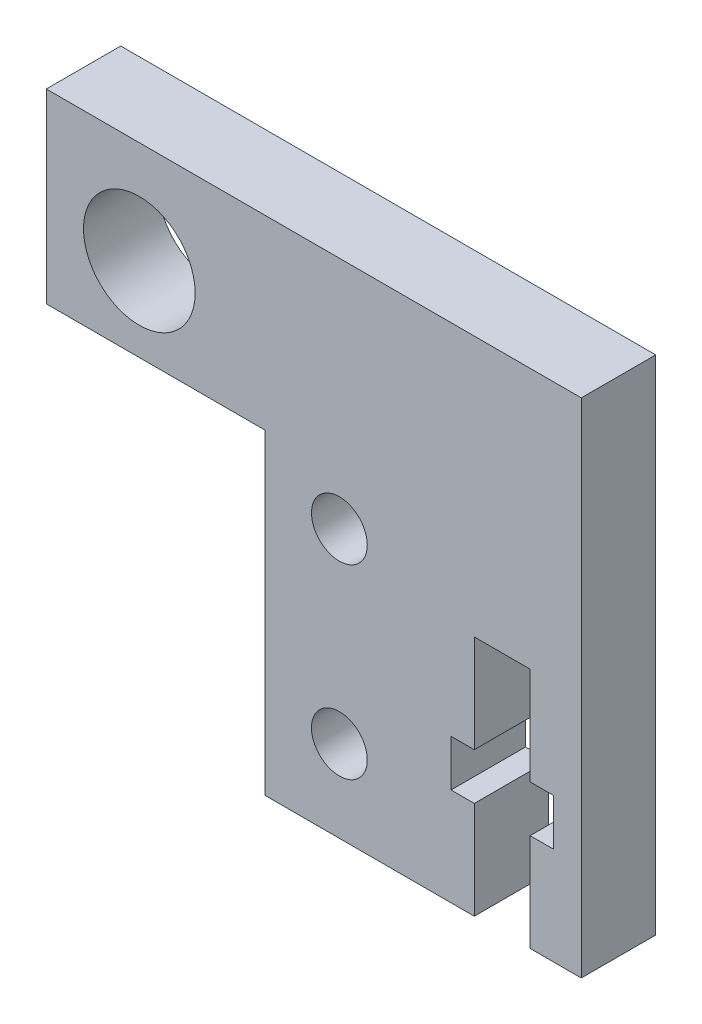
ISO-10303-21;
HEADER;
FILE_DESCRIPTION(('STEP AP214'),'2;1');
FILE_NAME('part.step','',(''),(''),'','','');
FILE_SCHEMA(('AUTOMOTIVE_DESIGN { 1 0 10303 214 1 1 1 1 }'));
ENDSEC;
DATA;
#1=APPLICATION_CONTEXT('core data for automotive mechanical design processes');
#2=APPLICATION_PROTOCOL_DEFINITION('international standard','automotive_design',2000,#1);
#3=PRODUCT_CONTEXT('',#1,'mechanical');
#4=PRODUCT('Part','Part','',(#3));
#5=PRODUCT_RELATED_PRODUCT_CATEGORY('part','',(#4));
#6=PRODUCT_DEFINITION_FORMATION('','',#4);
#7=PRODUCT_DEFINITION_CONTEXT('part definition',#1,'design');
#8=PRODUCT_DEFINITION('design','',#6,#7);
#9=PRODUCT_DEFINITION_SHAPE('','',#8);
#10=(LENGTH_UNIT() NAMED_UNIT(*) SI_UNIT(.MILLI.,.METRE.));
#11=(NAMED_UNIT(*) PLANE_ANGLE_UNIT() SI_UNIT($,.RADIAN.));
#12=(NAMED_UNIT(*) SI_UNIT($,.STERADIAN.) SOLID_ANGLE_UNIT());
#13=UNCERTAINTY_MEASURE_WITH_UNIT(LENGTH_MEASURE(1.E-05),#10,'distance_accuracy_value','');
#14=(GEOMETRIC_REPRESENTATION_CONTEXT(3) GLOBAL_UNCERTAINTY_ASSIGNED_CONTEXT((#13)) GLOBAL_UNIT_ASSIGNED_CONTEXT((#10,
#11,#12)) REPRESENTATION_CONTEXT('',''));
#15=CARTESIAN_POINT('',(0.,0.,0.));
#16=DIRECTION('',(0.,0.,1.));
#17=DIRECTION('',(1.,0.,0.));
#18=AXIS2_PLACEMENT_3D('',#15,#16,#17);
#19=CARTESIAN_POINT('',(0.,0.,4.));
#20=DIRECTION('',(1.,0.,0.));
#21=DIRECTION('',(0.,0.,-1.));
#22=AXIS2_PLACEMENT_3D('',#19,#20,#21);
#23=PLANE('',#22);
#24=DIRECTION('',(0.,0.,1.));
#25=VECTOR('',#24,1.);
#26=CARTESIAN_POINT('',(0.,17.,0.));
#27=LINE('',#26,#25);
#28=CARTESIAN_POINT('',(0.,17.,0.));
#29=VERTEX_POINT('',#28);
#30=CARTESIAN_POINT('',(0.,17.,4.));
#31=VERTEX_POINT('',#30);
#32=EDGE_CURVE('E54',#29,#31,#27,.T.);
#33=ORIENTED_EDGE('',*,*,#32,.F.);
#34=DIRECTION('',(0.,-1.,0.));
#35=VECTOR('',#34,1.);
#36=CARTESIAN_POINT('',(0.,0.,0.));
#37=LINE('',#36,#35);
#38=CARTESIAN_POINT('',(0.,0.,0.));
#39=VERTEX_POINT('',#38);
#40=EDGE_CURVE('E349',#29,#39,#37,.T.);
#41=ORIENTED_EDGE('',*,*,#40,.T.);
#42=DIRECTION('',(0.,0.,-1.));
#43=VECTOR('',#42,1.);
#44=CARTESIAN_POINT('',(0.,0.,4.));
#45=LINE('',#44,#43);
#46=CARTESIAN_POINT('',(0.,0.,4.));
#47=VERTEX_POINT('',#46);
#48=EDGE_CURVE('E11',#47,#39,#45,.T.);
#49=ORIENTED_EDGE('',*,*,#48,.F.);
#50=DIRECTION('',(0.,-1.,0.));
#51=VECTOR('',#50,1.);
#52=CARTESIAN_POINT('',(0.,0.,4.));
#53=LINE('',#52,#51);
#54=EDGE_CURVE('E177',#31,#47,#53,.T.);
#55=ORIENTED_EDGE('',*,*,#54,.F.);
#56=EDGE_LOOP('',(#33,#41,#49,#55));
#57=FACE_BOUND('',#56,.T.);
#58=ADVANCED_FACE('F39',(#57),#23,.F.);
#59=CARTESIAN_POINT('',(0.,0.,4.));
#60=DIRECTION('',(0.,1.,0.));
#61=DIRECTION('',(0.,0.,1.));
#62=AXIS2_PLACEMENT_3D('',#59,#60,#61);
#63=PLANE('',#62);
#64=DIRECTION('',(0.,0.,-1.));
#65=VECTOR('',#64,1.);
#66=CARTESIAN_POINT('',(11.25,0.,44.1948379770338));
#67=LINE('',#66,#65);
#68=CARTESIAN_POINT('',(11.25,0.,4.));
#69=VERTEX_POINT('',#68);
#70=CARTESIAN_POINT('',(11.25,0.,0.));
#71=VERTEX_POINT('',#70);
#72=EDGE_CURVE('E218',#69,#71,#67,.T.);
#73=ORIENTED_EDGE('',*,*,#72,.F.);
#74=DIRECTION('',(1.,0.,0.));
#75=VECTOR('',#74,1.);
#76=CARTESIAN_POINT('',(0.,0.,4.));
#77=LINE('',#76,#75);
#78=EDGE_CURVE('E356',#47,#69,#77,.T.);
#79=ORIENTED_EDGE('',*,*,#78,.F.);
#80=ORIENTED_EDGE('',*,*,#48,.T.);
#81=DIRECTION('',(1.,0.,0.));
#82=VECTOR('',#81,1.);
#83=CARTESIAN_POINT('',(0.,0.,0.));
#84=LINE('',#83,#82);
#85=EDGE_CURVE('E369',#39,#71,#84,.T.);
#86=ORIENTED_EDGE('',*,*,#85,.T.);
#87=EDGE_LOOP('',(#73,#79,#80,#86));
#88=FACE_BOUND('',#87,.T.);
#89=ADVANCED_FACE('F434',(#88),#63,.F.);
#90=CARTESIAN_POINT('',(0.,0.,4.));
#91=DIRECTION('',(0.,0.,-1.));
#92=DIRECTION('',(-1.,0.,0.));
#93=AXIS2_PLACEMENT_3D('',#90,#91,#92);
#94=PLANE('',#93);
#95=DIRECTION('',(-1.,0.,0.));
#96=VECTOR('',#95,1.);
#97=CARTESIAN_POINT('',(14.25,5.25,4.));
#98=LINE('',#97,#96);
#99=CARTESIAN_POINT('',(15.5,5.25,4.));
#100=VERTEX_POINT('',#99);
#101=CARTESIAN_POINT('',(14.25,5.25,4.));
#102=VERTEX_POINT('',#101);
#103=EDGE_CURVE('E253',#100,#102,#98,.T.);
#104=ORIENTED_EDGE('',*,*,#103,.T.);
#105=DIRECTION('',(0.,-1.,0.));
#106=VECTOR('',#105,1.);
#107=CARTESIAN_POINT('',(14.25,0.,4.));
#108=LINE('',#107,#106);
#109=CARTESIAN_POINT('',(14.25,0.,4.));
#110=VERTEX_POINT('',#109);
#111=EDGE_CURVE('E212',#102,#110,#108,.T.);
#112=ORIENTED_EDGE('',*,*,#111,.T.);
#113=CARTESIAN_POINT('',(17.,0.,4.));
#114=VERTEX_POINT('',#113);
#115=EDGE_CURVE('E355',#110,#114,#77,.T.);
#116=ORIENTED_EDGE('',*,*,#115,.T.);
#117=DIRECTION('',(0.,1.,0.));
#118=VECTOR('',#117,1.);
#119=CARTESIAN_POINT('',(17.,0.,4.));
#120=LINE('',#119,#118);
#121=CARTESIAN_POINT('',(17.,27.,4.));
#122=VERTEX_POINT('',#121);
#123=EDGE_CURVE('E360',#114,#122,#120,.T.);
#124=ORIENTED_EDGE('',*,*,#123,.T.);
#125=DIRECTION('',(-1.,0.,0.));
#126=VECTOR('',#125,1.);
#127=CARTESIAN_POINT('',(0.,27.,4.));
#128=LINE('',#127,#126);
#129=CARTESIAN_POINT('',(-11.75,27.,4.));
#130=VERTEX_POINT('',#129);
#131=EDGE_CURVE('E363',#122,#130,#128,.T.);
#132=ORIENTED_EDGE('',*,*,#131,.T.);
#133=DIRECTION('',(0.,-1.,0.));
#134=VECTOR('',#133,1.);
#135=CARTESIAN_POINT('',(-11.75,27.,4.));
#136=LINE('',#135,#134);
#137=CARTESIAN_POINT('',(-11.75,17.,4.));
#138=VERTEX_POINT('',#137);
#139=EDGE_CURVE('E186',#130,#138,#136,.T.);
#140=ORIENTED_EDGE('',*,*,#139,.T.);
#141=DIRECTION('',(1.,0.,0.));
#142=VECTOR('',#141,1.);
#143=CARTESIAN_POINT('',(0.,17.,4.));
#144=LINE('',#143,#142);
#145=EDGE_CURVE('E196',#138,#31,#144,.T.);
#146=ORIENTED_EDGE('',*,*,#145,.T.);
#147=ORIENTED_EDGE('',*,*,#54,.T.);
#148=ORIENTED_EDGE('',*,*,#78,.T.);
#149=DIRECTION('',(0.,1.,0.));
#150=VECTOR('',#149,1.);
#151=CARTESIAN_POINT('',(11.25,0.,4.));
#152=LINE('',#151,#150);
#153=CARTESIAN_POINT('',(11.25,5.25,4.));
#154=VERTEX_POINT('',#153);
#155=EDGE_CURVE('E224',#69,#154,#152,.T.);
#156=ORIENTED_EDGE('',*,*,#155,.T.);
#157=DIRECTION('',(-1.,0.,0.));
#158=VECTOR('',#157,1.);
#159=CARTESIAN_POINT('',(11.25,5.25,4.));
#160=LINE('',#159,#158);
#161=CARTESIAN_POINT('',(10.,5.25,4.));
#162=VERTEX_POINT('',#161);
#163=EDGE_CURVE('E285',#154,#162,#160,.T.);
#164=ORIENTED_EDGE('',*,*,#163,.T.);
#165=DIRECTION('',(0.,1.,0.));
#166=VECTOR('',#165,1.);
#167=CARTESIAN_POINT('',(10.,5.25,4.));
#168=LINE('',#167,#166);
#169=CARTESIAN_POINT('',(10.,7.75,4.));
#170=VERTEX_POINT('',#169);
#171=EDGE_CURVE('E281',#162,#170,#168,.T.);
#172=ORIENTED_EDGE('',*,*,#171,.T.);
#173=DIRECTION('',(1.,0.,0.));
#174=VECTOR('',#173,1.);
#175=CARTESIAN_POINT('',(10.,7.75,4.));
#176=LINE('',#175,#174);
#177=CARTESIAN_POINT('',(11.25,7.75,4.));
#178=VERTEX_POINT('',#177);
#179=EDGE_CURVE('E277',#170,#178,#176,.T.);
#180=ORIENTED_EDGE('',*,*,#179,.T.);
#181=DIRECTION('',(0.,1.,0.));
#182=VECTOR('',#181,1.);
#183=CARTESIAN_POINT('',(11.25,7.75,4.));
#184=LINE('',#183,#182);
#185=CARTESIAN_POINT('',(11.25,13.,4.));
#186=VERTEX_POINT('',#185);
#187=EDGE_CURVE('E273',#178,#186,#184,.T.);
#188=ORIENTED_EDGE('',*,*,#187,.T.);
#189=DIRECTION('',(1.,0.,0.));
#190=VECTOR('',#189,1.);
#191=CARTESIAN_POINT('',(11.25,13.,4.));
#192=LINE('',#191,#190);
#193=CARTESIAN_POINT('',(14.25,13.,4.));
#194=VERTEX_POINT('',#193);
#195=EDGE_CURVE('E269',#186,#194,#192,.T.);
#196=ORIENTED_EDGE('',*,*,#195,.T.);
#197=DIRECTION('',(0.,-1.,0.));
#198=VECTOR('',#197,1.);
#199=CARTESIAN_POINT('',(14.25,7.75,4.));
#200=LINE('',#199,#198);
#201=CARTESIAN_POINT('',(14.25,7.75,4.));
#202=VERTEX_POINT('',#201);
#203=EDGE_CURVE('E265',#194,#202,#200,.T.);
#204=ORIENTED_EDGE('',*,*,#203,.T.);
#205=DIRECTION('',(1.,0.,0.));
#206=VECTOR('',#205,1.);
#207=CARTESIAN_POINT('',(15.5,7.75,4.));
#208=LINE('',#207,#206);
#209=CARTESIAN_POINT('',(15.5,7.75,4.));
#210=VERTEX_POINT('',#209);
#211=EDGE_CURVE('E261',#202,#210,#208,.T.);
#212=ORIENTED_EDGE('',*,*,#211,.T.);
#213=DIRECTION('',(0.,-1.,0.));
#214=VECTOR('',#213,1.);
#215=CARTESIAN_POINT('',(15.5,5.25,4.));
#216=LINE('',#215,#214);
#217=EDGE_CURVE('E257',#210,#100,#216,.T.);
#218=ORIENTED_EDGE('',*,*,#217,.T.);
#219=EDGE_LOOP('',(#104,#112,#116,#124,#132,#140,#146,#147,#148,#156,#164,#172,#180,#188,#196,
#204,#212,#218));
#220=FACE_BOUND('',#219,.T.);
#221=CARTESIAN_POINT('',(4.,14.4,4.));
#222=DIRECTION('',(0.,0.,1.));
#223=DIRECTION('',(1.,0.,0.));
#224=AXIS2_PLACEMENT_3D('',#221,#222,#223);
#225=CIRCLE('',#224,1.5);
#226=CARTESIAN_POINT('',(5.5,14.4,4.));
#227=VERTEX_POINT('',#226);
#228=EDGE_CURVE('E345',#227,#227,#225,.T.);
#229=ORIENTED_EDGE('',*,*,#228,.F.);
#230=EDGE_LOOP('',(#229));
#231=FACE_BOUND('',#230,.T.);
#232=CARTESIAN_POINT('',(4.,4.4,4.));
#233=DIRECTION('',(0.,0.,1.));
#234=DIRECTION('',(-1.,0.,0.));
#235=AXIS2_PLACEMENT_3D('',#232,#233,#234);
#236=CIRCLE('',#235,1.5);
#237=CARTESIAN_POINT('',(2.5,4.4,4.));
#238=VERTEX_POINT('',#237);
#239=EDGE_CURVE('E337',#238,#238,#236,.T.);
#240=ORIENTED_EDGE('',*,*,#239,.F.);
#241=EDGE_LOOP('',(#240));
#242=FACE_BOUND('',#241,.T.);
#243=CARTESIAN_POINT('',(-6.75,21.5,4.));
#244=DIRECTION('',(0.,0.,1.));
#245=DIRECTION('',(1.,0.,0.));
#246=AXIS2_PLACEMENT_3D('',#243,#244,#245);
#247=CIRCLE('',#246,3.);
#248=CARTESIAN_POINT('',(-3.75,21.5,4.));
#249=VERTEX_POINT('',#248);
#250=EDGE_CURVE('E204',#249,#249,#247,.T.);
#251=ORIENTED_EDGE('',*,*,#250,.F.);
#252=EDGE_LOOP('',(#251));
#253=FACE_BOUND('',#252,.T.);
#254=ADVANCED_FACE('F389',(#220,#231,#242,#253),#94,.F.);
#255=CARTESIAN_POINT('',(0.,0.,0.));
#256=DIRECTION('',(0.,0.,-1.));
#257=DIRECTION('',(-1.,0.,0.));
#258=AXIS2_PLACEMENT_3D('',#255,#256,#257);
#259=PLANE('',#258);
#260=DIRECTION('',(0.,-1.,0.));
#261=VECTOR('',#260,1.);
#262=CARTESIAN_POINT('',(14.25,0.,0.));
#263=LINE('',#262,#261);
#264=CARTESIAN_POINT('',(14.25,5.25,0.));
#265=VERTEX_POINT('',#264);
#266=CARTESIAN_POINT('',(14.25,0.,0.));
#267=VERTEX_POINT('',#266);
#268=EDGE_CURVE('E215',#265,#267,#263,.T.);
#269=ORIENTED_EDGE('',*,*,#268,.F.);
#270=DIRECTION('',(-1.,0.,0.));
#271=VECTOR('',#270,1.);
#272=CARTESIAN_POINT('',(14.25,5.25,0.));
#273=LINE('',#272,#271);
#274=CARTESIAN_POINT('',(15.5,5.25,0.));
#275=VERTEX_POINT('',#274);
#276=EDGE_CURVE('E219',#275,#265,#273,.T.);
#277=ORIENTED_EDGE('',*,*,#276,.F.);
#278=DIRECTION('',(0.,-1.,0.));
#279=VECTOR('',#278,1.);
#280=CARTESIAN_POINT('',(15.5,5.25,0.));
#281=LINE('',#280,#279);
#282=CARTESIAN_POINT('',(15.5,7.75,0.));
#283=VERTEX_POINT('',#282);
#284=EDGE_CURVE('E245',#283,#275,#281,.T.);
#285=ORIENTED_EDGE('',*,*,#284,.F.);
#286=DIRECTION('',(1.,0.,0.));
#287=VECTOR('',#286,1.);
#288=CARTESIAN_POINT('',(15.5,7.75,0.));
#289=LINE('',#288,#287);
#290=CARTESIAN_POINT('',(14.25,7.75,0.));
#291=VERTEX_POINT('',#290);
#292=EDGE_CURVE('E242',#291,#283,#289,.T.);
#293=ORIENTED_EDGE('',*,*,#292,.F.);
#294=DIRECTION('',(0.,-1.,0.));
#295=VECTOR('',#294,1.);
#296=CARTESIAN_POINT('',(14.25,7.75,0.));
#297=LINE('',#296,#295);
#298=CARTESIAN_POINT('',(14.25,13.,0.));
#299=VERTEX_POINT('',#298);
#300=EDGE_CURVE('E239',#299,#291,#297,.T.);
#301=ORIENTED_EDGE('',*,*,#300,.F.);
#302=DIRECTION('',(1.,0.,0.));
#303=VECTOR('',#302,1.);
#304=CARTESIAN_POINT('',(11.25,13.,0.));
#305=LINE('',#304,#303);
#306=CARTESIAN_POINT('',(11.25,13.,0.));
#307=VERTEX_POINT('',#306);
#308=EDGE_CURVE('E236',#307,#299,#305,.T.);
#309=ORIENTED_EDGE('',*,*,#308,.F.);
#310=DIRECTION('',(0.,1.,0.));
#311=VECTOR('',#310,1.);
#312=CARTESIAN_POINT('',(11.25,7.75,0.));
#313=LINE('',#312,#311);
#314=CARTESIAN_POINT('',(11.25,7.75,0.));
#315=VERTEX_POINT('',#314);
#316=EDGE_CURVE('E233',#315,#307,#313,.T.);
#317=ORIENTED_EDGE('',*,*,#316,.F.);
#318=DIRECTION('',(1.,0.,0.));
#319=VECTOR('',#318,1.);
#320=CARTESIAN_POINT('',(10.,7.75,0.));
#321=LINE('',#320,#319);
#322=CARTESIAN_POINT('',(10.,7.75,0.));
#323=VERTEX_POINT('',#322);
#324=EDGE_CURVE('E230',#323,#315,#321,.T.);
#325=ORIENTED_EDGE('',*,*,#324,.F.);
#326=DIRECTION('',(0.,1.,0.));
#327=VECTOR('',#326,1.);
#328=CARTESIAN_POINT('',(10.,5.25,0.));
#329=LINE('',#328,#327);
#330=CARTESIAN_POINT('',(10.,5.25,0.));
#331=VERTEX_POINT('',#330);
#332=EDGE_CURVE('E227',#331,#323,#329,.T.);
#333=ORIENTED_EDGE('',*,*,#332,.F.);
#334=DIRECTION('',(-1.,0.,0.));
#335=VECTOR('',#334,1.);
#336=CARTESIAN_POINT('',(11.25,5.25,0.));
#337=LINE('',#336,#335);
#338=CARTESIAN_POINT('',(11.25,5.25,0.));
#339=VERTEX_POINT('',#338);
#340=EDGE_CURVE('E223',#339,#331,#337,.T.);
#341=ORIENTED_EDGE('',*,*,#340,.F.);
#342=DIRECTION('',(0.,1.,0.));
#343=VECTOR('',#342,1.);
#344=CARTESIAN_POINT('',(11.25,0.,0.));
#345=LINE('',#344,#343);
#346=EDGE_CURVE('E220',#71,#339,#345,.T.);
#347=ORIENTED_EDGE('',*,*,#346,.F.);
#348=ORIENTED_EDGE('',*,*,#85,.F.);
#349=ORIENTED_EDGE('',*,*,#40,.F.);
#350=DIRECTION('',(1.,0.,0.));
#351=VECTOR('',#350,1.);
#352=CARTESIAN_POINT('',(0.,17.,0.));
#353=LINE('',#352,#351);
#354=CARTESIAN_POINT('',(-11.75,17.,0.));
#355=VERTEX_POINT('',#354);
#356=EDGE_CURVE('E189',#355,#29,#353,.T.);
#357=ORIENTED_EDGE('',*,*,#356,.F.);
#358=DIRECTION('',(0.,-1.,0.));
#359=VECTOR('',#358,1.);
#360=CARTESIAN_POINT('',(-11.75,27.,0.));
#361=LINE('',#360,#359);
#362=CARTESIAN_POINT('',(-11.75,27.,0.));
#363=VERTEX_POINT('',#362);
#364=EDGE_CURVE('E183',#363,#355,#361,.T.);
#365=ORIENTED_EDGE('',*,*,#364,.F.);
#366=DIRECTION('',(-1.,0.,0.));
#367=VECTOR('',#366,1.);
#368=CARTESIAN_POINT('',(0.,27.,0.));
#369=LINE('',#368,#367);
#370=CARTESIAN_POINT('',(17.,27.,0.));
#371=VERTEX_POINT('',#370);
#372=EDGE_CURVE('E165',#371,#363,#369,.T.);
#373=ORIENTED_EDGE('',*,*,#372,.F.);
#374=DIRECTION('',(0.,1.,0.));
#375=VECTOR('',#374,1.);
#376=CARTESIAN_POINT('',(17.,0.,0.));
#377=LINE('',#376,#375);
#378=CARTESIAN_POINT('',(17.,0.,0.));
#379=VERTEX_POINT('',#378);
#380=EDGE_CURVE('E178',#379,#371,#377,.T.);
#381=ORIENTED_EDGE('',*,*,#380,.F.);
#382=EDGE_CURVE('E368',#267,#379,#84,.T.);
#383=ORIENTED_EDGE('',*,*,#382,.F.);
#384=EDGE_LOOP('',(#269,#277,#285,#293,#301,#309,#317,#325,#333,#341,#347,#348,#349,#357,#365,
#373,#381,#383));
#385=FACE_BOUND('',#384,.T.);
#386=CARTESIAN_POINT('',(4.,14.4,0.));
#387=DIRECTION('',(0.,0.,1.));
#388=DIRECTION('',(1.,0.,0.));
#389=AXIS2_PLACEMENT_3D('',#386,#387,#388);
#390=CIRCLE('',#389,1.5);
#391=CARTESIAN_POINT('',(5.5,14.4,0.));
#392=VERTEX_POINT('',#391);
#393=EDGE_CURVE('E341',#392,#392,#390,.T.);
#394=ORIENTED_EDGE('',*,*,#393,.T.);
#395=EDGE_LOOP('',(#394));
#396=FACE_BOUND('',#395,.T.);
#397=CARTESIAN_POINT('',(4.,4.4,0.));
#398=DIRECTION('',(0.,0.,1.));
#399=DIRECTION('',(-1.,0.,0.));
#400=AXIS2_PLACEMENT_3D('',#397,#398,#399);
#401=CIRCLE('',#400,1.5);
#402=CARTESIAN_POINT('',(2.5,4.4,0.));
#403=VERTEX_POINT('',#402);
#404=EDGE_CURVE('E336',#403,#403,#401,.T.);
#405=ORIENTED_EDGE('',*,*,#404,.T.);
#406=EDGE_LOOP('',(#405));
#407=FACE_BOUND('',#406,.T.);
#408=CARTESIAN_POINT('',(-6.75,21.5,0.));
#409=DIRECTION('',(0.,0.,1.));
#410=DIRECTION('',(1.,0.,0.));
#411=AXIS2_PLACEMENT_3D('',#408,#409,#410);
#412=CIRCLE('',#411,3.);
#413=CARTESIAN_POINT('',(-3.75,21.5,0.));
#414=VERTEX_POINT('',#413);
#415=EDGE_CURVE('E208',#414,#414,#412,.T.);
#416=ORIENTED_EDGE('',*,*,#415,.T.);
#417=EDGE_LOOP('',(#416));
#418=FACE_BOUND('',#417,.T.);
#419=ADVANCED_FACE('F192',(#385,#396,#407,#418),#259,.T.);
#420=ORIENTED_EDGE('',*,*,#115,.F.);
#421=DIRECTION('',(0.,0.,-1.));
#422=VECTOR('',#421,1.);
#423=CARTESIAN_POINT('',(14.25,0.,44.1948379770338));
#424=LINE('',#423,#422);
#425=EDGE_CURVE('E332',#110,#267,#424,.T.);
#426=ORIENTED_EDGE('',*,*,#425,.T.);
#427=ORIENTED_EDGE('',*,*,#382,.T.);
#428=DIRECTION('',(0.,0.,-1.));
#429=VECTOR('',#428,1.);
#430=CARTESIAN_POINT('',(17.,0.,4.));
#431=LINE('',#430,#429);
#432=EDGE_CURVE('E47',#114,#379,#431,.T.);
#433=ORIENTED_EDGE('',*,*,#432,.F.);
#434=EDGE_LOOP('',(#420,#426,#427,#433));
#435=FACE_BOUND('',#434,.T.);
#436=ADVANCED_FACE('F391',(#435),#63,.F.);
#437=CARTESIAN_POINT('',(17.,0.,4.));
#438=DIRECTION('',(-1.,0.,0.));
#439=DIRECTION('',(0.,0.,1.));
#440=AXIS2_PLACEMENT_3D('',#437,#438,#439);
#441=PLANE('',#440);
#442=ORIENTED_EDGE('',*,*,#380,.T.);
#443=DIRECTION('',(0.,0.,-1.));
#444=VECTOR('',#443,1.);
#445=CARTESIAN_POINT('',(17.,27.,4.));
#446=LINE('',#445,#444);
#447=EDGE_CURVE('E172',#122,#371,#446,.T.);
#448=ORIENTED_EDGE('',*,*,#447,.F.);
#449=ORIENTED_EDGE('',*,*,#123,.F.);
#450=ORIENTED_EDGE('',*,*,#432,.T.);
#451=EDGE_LOOP('',(#442,#448,#449,#450));
#452=FACE_BOUND('',#451,.T.);
#453=ADVANCED_FACE('F381',(#452),#441,.F.);
#454=CARTESIAN_POINT('',(0.,27.,4.));
#455=DIRECTION('',(0.,-1.,0.));
#456=DIRECTION('',(0.,0.,-1.));
#457=AXIS2_PLACEMENT_3D('',#454,#455,#456);
#458=PLANE('',#457);
#459=ORIENTED_EDGE('',*,*,#372,.T.);
#460=DIRECTION('',(0.,0.,1.));
#461=VECTOR('',#460,1.);
#462=CARTESIAN_POINT('',(-11.75,27.,0.));
#463=LINE('',#462,#461);
#464=EDGE_CURVE('E169',#363,#130,#463,.T.);
#465=ORIENTED_EDGE('',*,*,#464,.T.);
#466=ORIENTED_EDGE('',*,*,#131,.F.);
#467=ORIENTED_EDGE('',*,*,#447,.T.);
#468=EDGE_LOOP('',(#459,#465,#466,#467));
#469=FACE_BOUND('',#468,.T.);
#470=ADVANCED_FACE('F167',(#469),#458,.F.);
#471=CARTESIAN_POINT('',(4.,14.4,4.));
#472=DIRECTION('',(0.,0.,-1.));
#473=DIRECTION('',(-1.,0.,0.));
#474=AXIS2_PLACEMENT_3D('',#471,#472,#473);
#475=CYLINDRICAL_SURFACE('',#474,1.5);
#476=ORIENTED_EDGE('',*,*,#228,.T.);
#477=EDGE_LOOP('',(#476));
#478=FACE_BOUND('',#477,.T.);
#479=ORIENTED_EDGE('',*,*,#393,.F.);
#480=EDGE_LOOP('',(#479));
#481=FACE_BOUND('',#480,.T.);
#482=ADVANCED_FACE('F460',(#478,#481),#475,.F.);
#483=CARTESIAN_POINT('',(4.,4.4,4.));
#484=DIRECTION('',(0.,0.,-1.));
#485=DIRECTION('',(-1.,0.,0.));
#486=AXIS2_PLACEMENT_3D('',#483,#484,#485);
#487=CYLINDRICAL_SURFACE('',#486,1.5);
#488=ORIENTED_EDGE('',*,*,#239,.T.);
#489=EDGE_LOOP('',(#488));
#490=FACE_BOUND('',#489,.T.);
#491=ORIENTED_EDGE('',*,*,#404,.F.);
#492=EDGE_LOOP('',(#491));
#493=FACE_BOUND('',#492,.T.);
#494=ADVANCED_FACE('F464',(#490,#493),#487,.F.);
#495=CARTESIAN_POINT('',(14.25,0.,44.1948379770338));
#496=DIRECTION('',(-1.,0.,0.));
#497=DIRECTION('',(0.,0.,1.));
#498=AXIS2_PLACEMENT_3D('',#495,#496,#497);
#499=PLANE('',#498);
#500=ORIENTED_EDGE('',*,*,#111,.F.);
#501=DIRECTION('',(0.,0.,-1.));
#502=VECTOR('',#501,1.);
#503=CARTESIAN_POINT('',(14.25,5.25,44.1948379770338));
#504=LINE('',#503,#502);
#505=EDGE_CURVE('E328',#102,#265,#504,.T.);
#506=ORIENTED_EDGE('',*,*,#505,.T.);
#507=ORIENTED_EDGE('',*,*,#268,.T.);
#508=ORIENTED_EDGE('',*,*,#425,.F.);
#509=EDGE_LOOP('',(#500,#506,#507,#508));
#510=FACE_BOUND('',#509,.T.);
#511=ADVANCED_FACE('F393',(#510),#499,.T.);
#512=CARTESIAN_POINT('',(14.25,5.25,44.1948379770338));
#513=DIRECTION('',(0.,1.,0.));
#514=DIRECTION('',(0.,0.,1.));
#515=AXIS2_PLACEMENT_3D('',#512,#513,#514);
#516=PLANE('',#515);
#517=ORIENTED_EDGE('',*,*,#103,.F.);
#518=DIRECTION('',(0.,0.,-1.));
#519=VECTOR('',#518,1.);
#520=CARTESIAN_POINT('',(15.5,5.25,44.1948379770338));
#521=LINE('',#520,#519);
#522=EDGE_CURVE('E324',#100,#275,#521,.T.);
#523=ORIENTED_EDGE('',*,*,#522,.T.);
#524=ORIENTED_EDGE('',*,*,#276,.T.);
#525=ORIENTED_EDGE('',*,*,#505,.F.);
#526=EDGE_LOOP('',(#517,#523,#524,#525));
#527=FACE_BOUND('',#526,.T.);
#528=ADVANCED_FACE('F396',(#527),#516,.T.);
#529=CARTESIAN_POINT('',(15.5,5.25,44.1948379770338));
#530=DIRECTION('',(-1.,0.,0.));
#531=DIRECTION('',(0.,-1.,0.));
#532=AXIS2_PLACEMENT_3D('',#529,#530,#531);
#533=PLANE('',#532);
#534=ORIENTED_EDGE('',*,*,#217,.F.);
#535=DIRECTION('',(0.,0.,-1.));
#536=VECTOR('',#535,1.);
#537=CARTESIAN_POINT('',(15.5,7.75,44.1948379770338));
#538=LINE('',#537,#536);
#539=EDGE_CURVE('E320',#210,#283,#538,.T.);
#540=ORIENTED_EDGE('',*,*,#539,.T.);
#541=ORIENTED_EDGE('',*,*,#284,.T.);
#542=ORIENTED_EDGE('',*,*,#522,.F.);
#543=EDGE_LOOP('',(#534,#540,#541,#542));
#544=FACE_BOUND('',#543,.T.);
#545=ADVANCED_FACE('F400',(#544),#533,.T.);
#546=CARTESIAN_POINT('',(15.5,7.75,44.1948379770338));
#547=DIRECTION('',(0.,-1.,0.));
#548=DIRECTION('',(0.,0.,-1.));
#549=AXIS2_PLACEMENT_3D('',#546,#547,#548);
#550=PLANE('',#549);
#551=ORIENTED_EDGE('',*,*,#211,.F.);
#552=DIRECTION('',(0.,0.,-1.));
#553=VECTOR('',#552,1.);
#554=CARTESIAN_POINT('',(14.25,7.75,44.1948379770338));
#555=LINE('',#554,#553);
#556=EDGE_CURVE('E316',#202,#291,#555,.T.);
#557=ORIENTED_EDGE('',*,*,#556,.T.);
#558=ORIENTED_EDGE('',*,*,#292,.T.);
#559=ORIENTED_EDGE('',*,*,#539,.F.);
#560=EDGE_LOOP('',(#551,#557,#558,#559));
#561=FACE_BOUND('',#560,.T.);
#562=ADVANCED_FACE('F403',(#561),#550,.T.);
#563=CARTESIAN_POINT('',(14.25,7.75,44.1948379770338));
#564=DIRECTION('',(-1.,0.,0.));
#565=DIRECTION('',(0.,0.,1.));
#566=AXIS2_PLACEMENT_3D('',#563,#564,#565);
#567=PLANE('',#566);
#568=ORIENTED_EDGE('',*,*,#203,.F.);
#569=DIRECTION('',(0.,0.,-1.));
#570=VECTOR('',#569,1.);
#571=CARTESIAN_POINT('',(14.25,13.,44.1948379770338));
#572=LINE('',#571,#570);
#573=EDGE_CURVE('E312',#194,#299,#572,.T.);
#574=ORIENTED_EDGE('',*,*,#573,.T.);
#575=ORIENTED_EDGE('',*,*,#300,.T.);
#576=ORIENTED_EDGE('',*,*,#556,.F.);
#577=EDGE_LOOP('',(#568,#574,#575,#576));
#578=FACE_BOUND('',#577,.T.);
#579=ADVANCED_FACE('F410',(#578),#567,.T.);
#580=CARTESIAN_POINT('',(11.25,13.,44.1948379770338));
#581=DIRECTION('',(0.,-1.,0.));
#582=DIRECTION('',(0.,0.,-1.));
#583=AXIS2_PLACEMENT_3D('',#580,#581,#582);
#584=PLANE('',#583);
#585=ORIENTED_EDGE('',*,*,#195,.F.);
#586=DIRECTION('',(0.,0.,-1.));
#587=VECTOR('',#586,1.);
#588=CARTESIAN_POINT('',(11.25,13.,44.1948379770338));
#589=LINE('',#588,#587);
#590=EDGE_CURVE('E308',#186,#307,#589,.T.);
#591=ORIENTED_EDGE('',*,*,#590,.T.);
#592=ORIENTED_EDGE('',*,*,#308,.T.);
#593=ORIENTED_EDGE('',*,*,#573,.F.);
#594=EDGE_LOOP('',(#585,#591,#592,#593));
#595=FACE_BOUND('',#594,.T.);
#596=ADVANCED_FACE('F413',(#595),#584,.T.);
#597=CARTESIAN_POINT('',(11.25,7.75,44.1948379770338));
#598=DIRECTION('',(1.,0.,0.));
#599=DIRECTION('',(0.,0.,-1.));
#600=AXIS2_PLACEMENT_3D('',#597,#598,#599);
#601=PLANE('',#600);
#602=ORIENTED_EDGE('',*,*,#187,.F.);
#603=DIRECTION('',(0.,0.,-1.));
#604=VECTOR('',#603,1.);
#605=CARTESIAN_POINT('',(11.25,7.75,44.1948379770338));
#606=LINE('',#605,#604);
#607=EDGE_CURVE('E304',#178,#315,#606,.T.);
#608=ORIENTED_EDGE('',*,*,#607,.T.);
#609=ORIENTED_EDGE('',*,*,#316,.T.);
#610=ORIENTED_EDGE('',*,*,#590,.F.);
#611=EDGE_LOOP('',(#602,#608,#609,#610));
#612=FACE_BOUND('',#611,.T.);
#613=ADVANCED_FACE('F417',(#612),#601,.T.);
#614=CARTESIAN_POINT('',(10.,7.75,44.1948379770338));
#615=DIRECTION('',(0.,-1.,0.));
#616=DIRECTION('',(0.,0.,-1.));
#617=AXIS2_PLACEMENT_3D('',#614,#615,#616);
#618=PLANE('',#617);
#619=ORIENTED_EDGE('',*,*,#179,.F.);
#620=DIRECTION('',(0.,0.,-1.));
#621=VECTOR('',#620,1.);
#622=CARTESIAN_POINT('',(10.,7.75,44.1948379770338));
#623=LINE('',#622,#621);
#624=EDGE_CURVE('E300',#170,#323,#623,.T.);
#625=ORIENTED_EDGE('',*,*,#624,.T.);
#626=ORIENTED_EDGE('',*,*,#324,.T.);
#627=ORIENTED_EDGE('',*,*,#607,.F.);
#628=EDGE_LOOP('',(#619,#625,#626,#627));
#629=FACE_BOUND('',#628,.T.);
#630=ADVANCED_FACE('F419',(#629),#618,.T.);
#631=CARTESIAN_POINT('',(10.,5.25,44.1948379770338));
#632=DIRECTION('',(1.,0.,0.));
#633=DIRECTION('',(0.,0.,-1.));
#634=AXIS2_PLACEMENT_3D('',#631,#632,#633);
#635=PLANE('',#634);
#636=ORIENTED_EDGE('',*,*,#171,.F.);
#637=DIRECTION('',(0.,0.,-1.));
#638=VECTOR('',#637,1.);
#639=CARTESIAN_POINT('',(10.,5.25,44.1948379770338));
#640=LINE('',#639,#638);
#641=EDGE_CURVE('E296',#162,#331,#640,.T.);
#642=ORIENTED_EDGE('',*,*,#641,.T.);
#643=ORIENTED_EDGE('',*,*,#332,.T.);
#644=ORIENTED_EDGE('',*,*,#624,.F.);
#645=EDGE_LOOP('',(#636,#642,#643,#644));
#646=FACE_BOUND('',#645,.T.);
#647=ADVANCED_FACE('F426',(#646),#635,.T.);
#648=CARTESIAN_POINT('',(11.25,5.25,44.1948379770338));
#649=DIRECTION('',(0.,1.,0.));
#650=DIRECTION('',(0.,0.,1.));
#651=AXIS2_PLACEMENT_3D('',#648,#649,#650);
#652=PLANE('',#651);
#653=ORIENTED_EDGE('',*,*,#163,.F.);
#654=DIRECTION('',(0.,0.,-1.));
#655=VECTOR('',#654,1.);
#656=CARTESIAN_POINT('',(11.25,5.25,44.1948379770338));
#657=LINE('',#656,#655);
#658=EDGE_CURVE('E62',#154,#339,#657,.T.);
#659=ORIENTED_EDGE('',*,*,#658,.T.);
#660=ORIENTED_EDGE('',*,*,#340,.T.);
#661=ORIENTED_EDGE('',*,*,#641,.F.);
#662=EDGE_LOOP('',(#653,#659,#660,#661));
#663=FACE_BOUND('',#662,.T.);
#664=ADVANCED_FACE('F428',(#663),#652,.T.);
#665=CARTESIAN_POINT('',(11.25,0.,44.1948379770338));
#666=DIRECTION('',(1.,0.,0.));
#667=DIRECTION('',(0.,0.,-1.));
#668=AXIS2_PLACEMENT_3D('',#665,#666,#667);
#669=PLANE('',#668);
#670=ORIENTED_EDGE('',*,*,#155,.F.);
#671=ORIENTED_EDGE('',*,*,#72,.T.);
#672=ORIENTED_EDGE('',*,*,#346,.T.);
#673=ORIENTED_EDGE('',*,*,#658,.F.);
#674=EDGE_LOOP('',(#670,#671,#672,#673));
#675=FACE_BOUND('',#674,.T.);
#676=ADVANCED_FACE('F432',(#675),#669,.T.);
#677=CARTESIAN_POINT('',(0.,17.,0.));
#678=DIRECTION('',(0.,-1.,0.));
#679=DIRECTION('',(0.,0.,-1.));
#680=AXIS2_PLACEMENT_3D('',#677,#678,#679);
#681=PLANE('',#680);
#682=ORIENTED_EDGE('',*,*,#145,.F.);
#683=DIRECTION('',(0.,0.,1.));
#684=VECTOR('',#683,1.);
#685=CARTESIAN_POINT('',(-11.75,17.,0.));
#686=LINE('',#685,#684);
#687=EDGE_CURVE('E188',#355,#138,#686,.T.);
#688=ORIENTED_EDGE('',*,*,#687,.F.);
#689=ORIENTED_EDGE('',*,*,#356,.T.);
#690=ORIENTED_EDGE('',*,*,#32,.T.);
#691=EDGE_LOOP('',(#682,#688,#689,#690));
#692=FACE_BOUND('',#691,.T.);
#693=ADVANCED_FACE('F439',(#692),#681,.T.);
#694=CARTESIAN_POINT('',(-11.75,27.,0.));
#695=DIRECTION('',(-1.,0.,0.));
#696=DIRECTION('',(0.,-1.,0.));
#697=AXIS2_PLACEMENT_3D('',#694,#695,#696);
#698=PLANE('',#697);
#699=ORIENTED_EDGE('',*,*,#139,.F.);
#700=ORIENTED_EDGE('',*,*,#464,.F.);
#701=ORIENTED_EDGE('',*,*,#364,.T.);
#702=ORIENTED_EDGE('',*,*,#687,.T.);
#703=EDGE_LOOP('',(#699,#700,#701,#702));
#704=FACE_BOUND('',#703,.T.);
#705=ADVANCED_FACE('F182',(#704),#698,.T.);
#706=CARTESIAN_POINT('',(-6.75,21.5,0.));
#707=DIRECTION('',(0.,0.,1.));
#708=DIRECTION('',(1.,0.,0.));
#709=AXIS2_PLACEMENT_3D('',#706,#707,#708);
#710=CYLINDRICAL_SURFACE('',#709,3.);
#711=ORIENTED_EDGE('',*,*,#415,.F.);
#712=EDGE_LOOP('',(#711));
#713=FACE_BOUND('',#712,.T.);
#714=ORIENTED_EDGE('',*,*,#250,.T.);
#715=EDGE_LOOP('',(#714));
#716=FACE_BOUND('',#715,.T.);
#717=ADVANCED_FACE('F497',(#713,#716),#710,.F.);
#718=CLOSED_SHELL('',(#58,#89,#254,#419,#436,#453,#470,#482,#494,#511,#528,#545,#562,#579,#596,
#613,#630,#647,#664,#676,#693,#705,#717));
#719=MANIFOLD_SOLID_BREP('B2',#718);
#720=ADVANCED_BREP_SHAPE_REPRESENTATION('',(#18,#719),#14);
#721=SHAPE_DEFINITION_REPRESENTATION(#9,#720);
ENDSEC;
END-ISO-10303-21;
